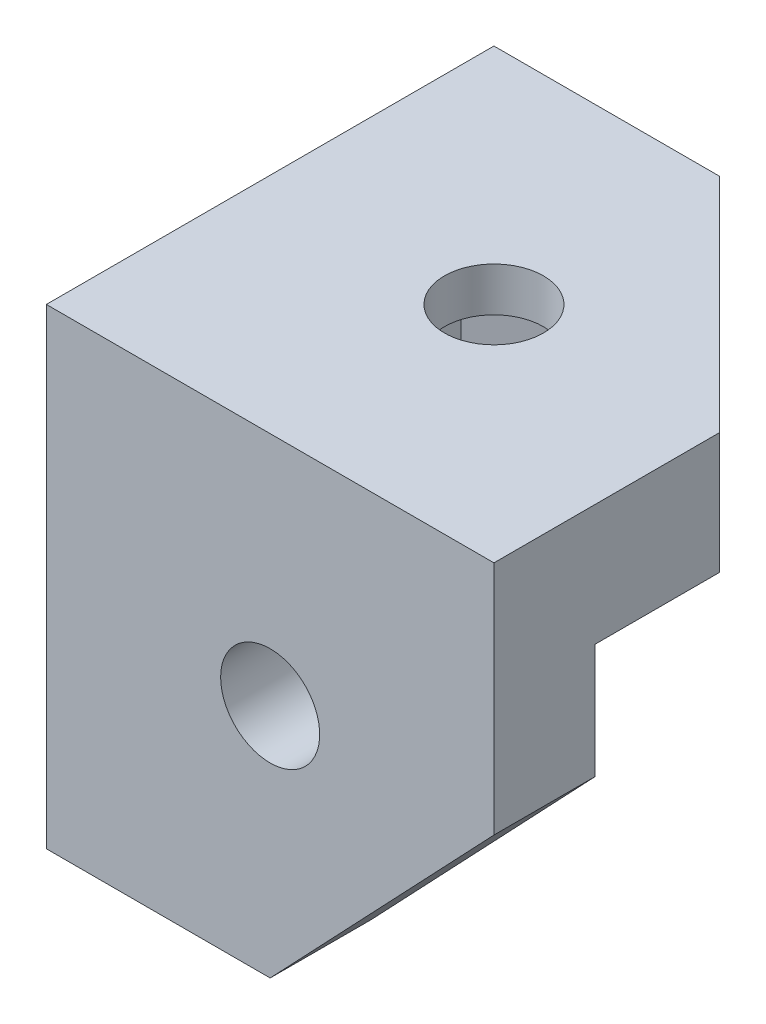
ISO-10303-21;
HEADER;
FILE_DESCRIPTION(('STEP AP214'),'2;1');
FILE_NAME('part.step','',(''),(''),'','','');
FILE_SCHEMA(('AUTOMOTIVE_DESIGN { 1 0 10303 214 1 1 1 1 }'));
ENDSEC;
DATA;
#1=APPLICATION_CONTEXT('core data for automotive mechanical design processes');
#2=APPLICATION_PROTOCOL_DEFINITION('international standard','automotive_design',2000,#1);
#3=PRODUCT_CONTEXT('',#1,'mechanical');
#4=PRODUCT('Part','Part','',(#3));
#5=PRODUCT_RELATED_PRODUCT_CATEGORY('part','',(#4));
#6=PRODUCT_DEFINITION_FORMATION('','',#4);
#7=PRODUCT_DEFINITION_CONTEXT('part definition',#1,'design');
#8=PRODUCT_DEFINITION('design','',#6,#7);
#9=PRODUCT_DEFINITION_SHAPE('','',#8);
#10=(LENGTH_UNIT() NAMED_UNIT(*) SI_UNIT(.MILLI.,.METRE.));
#11=(NAMED_UNIT(*) PLANE_ANGLE_UNIT() SI_UNIT($,.RADIAN.));
#12=(NAMED_UNIT(*) SI_UNIT($,.STERADIAN.) SOLID_ANGLE_UNIT());
#13=UNCERTAINTY_MEASURE_WITH_UNIT(LENGTH_MEASURE(1.E-05),#10,'distance_accuracy_value','');
#14=(GEOMETRIC_REPRESENTATION_CONTEXT(3) GLOBAL_UNCERTAINTY_ASSIGNED_CONTEXT((#13)) GLOBAL_UNIT_ASSIGNED_CONTEXT((#10,
#11,#12)) REPRESENTATION_CONTEXT('',''));
#15=CARTESIAN_POINT('',(0.,0.,0.));
#16=DIRECTION('',(0.,0.,1.));
#17=DIRECTION('',(1.,0.,0.));
#18=AXIS2_PLACEMENT_3D('',#15,#16,#17);
#19=CARTESIAN_POINT('',(16.14,34.000012,-16.14));
#20=DIRECTION('',(0.,-1.,0.));
#21=DIRECTION('',(0.,0.,-1.));
#22=AXIS2_PLACEMENT_3D('',#19,#20,#21);
#23=CYLINDRICAL_SURFACE('',#22,3.571875);
#24=CARTESIAN_POINT('',(16.14,34.,-16.14));
#25=DIRECTION('',(0.,-1.,0.));
#26=DIRECTION('',(0.,0.,-1.));
#27=AXIS2_PLACEMENT_3D('',#24,#25,#26);
#28=CIRCLE('',#27,3.571875);
#29=CARTESIAN_POINT('',(16.14,34.,-19.711875));
#30=VERTEX_POINT('',#29);
#31=EDGE_CURVE('E193',#30,#30,#28,.F.);
#32=ORIENTED_EDGE('',*,*,#31,.T.);
#33=EDGE_LOOP('',(#32));
#34=FACE_BOUND('',#33,.T.);
#35=CARTESIAN_POINT('',(16.14,30.825,-16.14));
#36=DIRECTION('',(0.,-1.,0.));
#37=DIRECTION('',(0.,0.,-1.));
#38=AXIS2_PLACEMENT_3D('',#35,#36,#37);
#39=CIRCLE('',#38,3.571875);
#40=CARTESIAN_POINT('',(16.14,30.825,-19.711875));
#41=VERTEX_POINT('',#40);
#42=EDGE_CURVE('E41',#41,#41,#39,.T.);
#43=ORIENTED_EDGE('',*,*,#42,.T.);
#44=EDGE_LOOP('',(#43));
#45=FACE_BOUND('',#44,.T.);
#46=ADVANCED_FACE('F37',(#34,#45),#23,.F.);
#47=CARTESIAN_POINT('',(0.,25.26875,0.));
#48=DIRECTION('',(0.,-1.,0.));
#49=DIRECTION('',(0.,0.,-1.));
#50=AXIS2_PLACEMENT_3D('',#47,#48,#49);
#51=PLANE('',#50);
#52=DIRECTION('',(0.707106781186548,0.,0.707106781186547));
#53=VECTOR('',#52,1.);
#54=CARTESIAN_POINT('',(16.2767142194378,25.26875,-32.28));
#55=LINE('',#54,#53);
#56=CARTESIAN_POINT('',(16.2767142194378,25.26875,-32.28));
#57=VERTEX_POINT('',#56);
#58=CARTESIAN_POINT('',(32.2799999999902,25.26875,-16.2767142194298));
#59=VERTEX_POINT('',#58);
#60=EDGE_CURVE('E306',#57,#59,#55,.T.);
#61=ORIENTED_EDGE('',*,*,#60,.T.);
#62=DIRECTION('',(0.,0.,1.));
#63=VECTOR('',#62,1.);
#64=CARTESIAN_POINT('',(32.2800000000711,25.26875,291559.995));
#65=LINE('',#64,#63);
#66=CARTESIAN_POINT('',(32.2800000000143,25.26875,-7.29257812498897));
#67=VERTEX_POINT('',#66);
#68=EDGE_CURVE('E200',#59,#67,#65,.T.);
#69=ORIENTED_EDGE('',*,*,#68,.T.);
#70=DIRECTION('',(-1.,0.,0.));
#71=VECTOR('',#70,1.);
#72=CARTESIAN_POINT('',(-399980.95,25.26875,-7.29257812497508));
#73=LINE('',#72,#71);
#74=CARTESIAN_POINT('',(7.29257812497508,25.26875,-7.29257812498896));
#75=VERTEX_POINT('',#74);
#76=EDGE_CURVE('E256',#67,#75,#73,.T.);
#77=ORIENTED_EDGE('',*,*,#76,.T.);
#78=DIRECTION('',(0.,0.,-1.));
#79=VECTOR('',#78,1.);
#80=CARTESIAN_POINT('',(7.29257812503192,25.26875,291559.995));
#81=LINE('',#80,#79);
#82=CARTESIAN_POINT('',(7.29257812500156,25.26875,-32.2800000000143));
#83=VERTEX_POINT('',#82);
#84=EDGE_CURVE('E252',#75,#83,#81,.T.);
#85=ORIENTED_EDGE('',*,*,#84,.T.);
#86=DIRECTION('',(1.,0.,0.));
#87=VECTOR('',#86,1.);
#88=CARTESIAN_POINT('',(-399980.95,25.26875,-32.2800000000143));
#89=LINE('',#88,#87);
#90=EDGE_CURVE('E255',#83,#57,#89,.T.);
#91=ORIENTED_EDGE('',*,*,#90,.T.);
#92=EDGE_LOOP('',(#61,#69,#77,#85,#91));
#93=FACE_BOUND('',#92,.T.);
#94=DIRECTION('',(0.866025403784439,0.,0.5));
#95=VECTOR('',#94,1.);
#96=CARTESIAN_POINT('',(8.19609063356097,25.26875,-14.196045400767));
#97=LINE('',#96,#95);
#98=CARTESIAN_POINT('',(10.4845312500572,25.26875,-12.8748135947916));
#99=VERTEX_POINT('',#98);
#100=CARTESIAN_POINT('',(16.140000000064,25.26875,-9.60962718960445));
#101=VERTEX_POINT('',#100);
#102=EDGE_CURVE('E46',#99,#101,#97,.T.);
#103=ORIENTED_EDGE('',*,*,#102,.T.);
#104=DIRECTION('',(0.866025403784439,0.,-0.5));
#105=VECTOR('',#104,1.);
#106=CARTESIAN_POINT('',(-0.126090633543185,25.26875,-0.218395383655346));
#107=LINE('',#106,#105);
#108=CARTESIAN_POINT('',(21.7954687499855,25.26875,-12.8748135947774));
#109=VERTEX_POINT('',#108);
#110=EDGE_CURVE('E12',#101,#109,#107,.T.);
#111=ORIENTED_EDGE('',*,*,#110,.T.);
#112=DIRECTION('',(0.,0.,-1.));
#113=VECTOR('',#112,1.);
#114=CARTESIAN_POINT('',(21.7954687499855,25.26875,0.));
#115=LINE('',#114,#113);
#116=CARTESIAN_POINT('',(21.7954687499855,25.26875,-19.4051864052796));
#117=VERTEX_POINT('',#116);
#118=EDGE_CURVE('E189',#109,#117,#115,.T.);
#119=ORIENTED_EDGE('',*,*,#118,.T.);
#120=DIRECTION('',(-0.866025403784439,0.,-0.5));
#121=VECTOR('',#120,1.);
#122=CARTESIAN_POINT('',(13.8515593835891,25.26875,-23.9916046164337));
#123=LINE('',#122,#121);
#124=CARTESIAN_POINT('',(16.1400000001777,25.26875,-22.6703728105235));
#125=VERTEX_POINT('',#124);
#126=EDGE_CURVE('E205',#117,#125,#123,.T.);
#127=ORIENTED_EDGE('',*,*,#126,.T.);
#128=DIRECTION('',(-0.866025403784439,0.,0.5));
#129=VECTOR('',#128,1.);
#130=CARTESIAN_POINT('',(-5.78155938354996,25.26875,-10.0139545992851));
#131=LINE('',#130,#129);
#132=CARTESIAN_POINT('',(10.4845312499926,25.26875,-19.4051864052653));
#133=VERTEX_POINT('',#132);
#134=EDGE_CURVE('E208',#125,#133,#131,.T.);
#135=ORIENTED_EDGE('',*,*,#134,.T.);
#136=DIRECTION('',(0.,0.,1.));
#137=VECTOR('',#136,1.);
#138=CARTESIAN_POINT('',(10.4845312499926,25.26875,0.));
#139=LINE('',#138,#137);
#140=EDGE_CURVE('E211',#133,#99,#139,.T.);
#141=ORIENTED_EDGE('',*,*,#140,.T.);
#142=EDGE_LOOP('',(#103,#111,#119,#127,#135,#141));
#143=FACE_BOUND('',#142,.T.);
#144=ADVANCED_FACE('F216',(#93,#143),#51,.T.);
#145=CARTESIAN_POINT('',(32.28,34.,-32.28));
#146=DIRECTION('',(-1.,0.,0.));
#147=DIRECTION('',(0.,0.,1.));
#148=AXIS2_PLACEMENT_3D('',#145,#146,#147);
#149=PLANE('',#148);
#150=DIRECTION('',(0.,-1.,0.));
#151=VECTOR('',#150,1.);
#152=CARTESIAN_POINT('',(32.28,34.,0.));
#153=LINE('',#152,#151);
#154=CARTESIAN_POINT('',(32.28,34.,0.));
#155=VERTEX_POINT('',#154);
#156=CARTESIAN_POINT('',(32.28,17.,0.));
#157=VERTEX_POINT('',#156);
#158=EDGE_CURVE('E185',#155,#157,#153,.T.);
#159=ORIENTED_EDGE('',*,*,#158,.T.);
#160=DIRECTION('',(0.,0.,1.));
#161=VECTOR('',#160,1.);
#162=CARTESIAN_POINT('',(32.28,17.,-30.7339859325418));
#163=LINE('',#162,#161);
#164=CARTESIAN_POINT('',(32.28,17.,-7.29257812498897));
#165=VERTEX_POINT('',#164);
#166=EDGE_CURVE('E152',#165,#157,#163,.T.);
#167=ORIENTED_EDGE('',*,*,#166,.F.);
#168=DIRECTION('',(0.,-1.,0.));
#169=VECTOR('',#168,1.);
#170=CARTESIAN_POINT('',(32.2800000000143,69.3375509044088,-7.29257812498897));
#171=LINE('',#170,#169);
#172=EDGE_CURVE('E249',#67,#165,#171,.T.);
#173=ORIENTED_EDGE('',*,*,#172,.F.);
#174=ORIENTED_EDGE('',*,*,#68,.F.);
#175=DIRECTION('',(0.,1.,0.));
#176=VECTOR('',#175,1.);
#177=CARTESIAN_POINT('',(32.28,-0.001000000000001,-16.2767142194378));
#178=LINE('',#177,#176);
#179=CARTESIAN_POINT('',(32.28,34.,-16.2767142194378));
#180=VERTEX_POINT('',#179);
#181=EDGE_CURVE('E311',#59,#180,#178,.T.);
#182=ORIENTED_EDGE('',*,*,#181,.T.);
#183=DIRECTION('',(0.,0.,-1.));
#184=VECTOR('',#183,1.);
#185=CARTESIAN_POINT('',(32.28,34.,-32.28));
#186=LINE('',#185,#184);
#187=EDGE_CURVE('E273',#155,#180,#186,.T.);
#188=ORIENTED_EDGE('',*,*,#187,.F.);
#189=EDGE_LOOP('',(#159,#167,#173,#174,#182,#188));
#190=FACE_BOUND('',#189,.T.);
#191=ADVANCED_FACE('F309',(#190),#149,.F.);
#192=CARTESIAN_POINT('',(0.,34.,-32.28));
#193=DIRECTION('',(0.,0.,1.));
#194=DIRECTION('',(1.,0.,0.));
#195=AXIS2_PLACEMENT_3D('',#192,#193,#194);
#196=PLANE('',#195);
#197=DIRECTION('',(0.,-1.,0.));
#198=VECTOR('',#197,1.);
#199=CARTESIAN_POINT('',(7.29257812500156,69.3375509044088,-32.2800000000143));
#200=LINE('',#199,#198);
#201=CARTESIAN_POINT('',(7.29257812500156,17.,-32.2800000000143));
#202=VERTEX_POINT('',#201);
#203=EDGE_CURVE('E265',#83,#202,#200,.T.);
#204=ORIENTED_EDGE('',*,*,#203,.T.);
#205=DIRECTION('',(-1.,0.,0.));
#206=VECTOR('',#205,1.);
#207=CARTESIAN_POINT('',(30.7339859325544,17.,-32.28));
#208=LINE('',#207,#206);
#209=CARTESIAN_POINT('',(0.,17.,-32.28));
#210=VERTEX_POINT('',#209);
#211=EDGE_CURVE('E61',#202,#210,#208,.T.);
#212=ORIENTED_EDGE('',*,*,#211,.T.);
#213=DIRECTION('',(0.,-1.,0.));
#214=VECTOR('',#213,1.);
#215=CARTESIAN_POINT('',(0.,34.,-32.28));
#216=LINE('',#215,#214);
#217=CARTESIAN_POINT('',(0.,34.,-32.28));
#218=VERTEX_POINT('',#217);
#219=EDGE_CURVE('E182',#218,#210,#216,.T.);
#220=ORIENTED_EDGE('',*,*,#219,.F.);
#221=DIRECTION('',(-1.,0.,0.));
#222=VECTOR('',#221,1.);
#223=CARTESIAN_POINT('',(0.,34.,-32.28));
#224=LINE('',#223,#222);
#225=CARTESIAN_POINT('',(16.2767142194378,34.,-32.28));
#226=VERTEX_POINT('',#225);
#227=EDGE_CURVE('E186',#226,#218,#224,.T.);
#228=ORIENTED_EDGE('',*,*,#227,.F.);
#229=DIRECTION('',(0.,1.,0.));
#230=VECTOR('',#229,1.);
#231=CARTESIAN_POINT('',(16.2767142194378,-0.001000000000001,-32.28));
#232=LINE('',#231,#230);
#233=EDGE_CURVE('E320',#57,#226,#232,.T.);
#234=ORIENTED_EDGE('',*,*,#233,.F.);
#235=ORIENTED_EDGE('',*,*,#90,.F.);
#236=EDGE_LOOP('',(#204,#212,#220,#228,#234,#235));
#237=FACE_BOUND('',#236,.T.);
#238=ADVANCED_FACE('F284',(#237),#196,.F.);
#239=CARTESIAN_POINT('',(0.,0.,0.));
#240=DIRECTION('',(0.,-1.,0.));
#241=DIRECTION('',(0.,0.,-1.));
#242=AXIS2_PLACEMENT_3D('',#239,#240,#241);
#243=PLANE('',#242);
#244=DIRECTION('',(0.,0.,1.));
#245=VECTOR('',#244,1.);
#246=CARTESIAN_POINT('',(16.14,0.,-30.7339859325418));
#247=LINE('',#246,#245);
#248=CARTESIAN_POINT('',(16.1400000000071,0.,-7.29257812498896));
#249=VERTEX_POINT('',#248);
#250=CARTESIAN_POINT('',(16.14,0.,0.));
#251=VERTEX_POINT('',#250);
#252=EDGE_CURVE('E53',#249,#251,#247,.T.);
#253=ORIENTED_EDGE('',*,*,#252,.T.);
#254=DIRECTION('',(1.,0.,0.));
#255=VECTOR('',#254,1.);
#256=CARTESIAN_POINT('',(0.,0.,0.));
#257=LINE('',#256,#255);
#258=CARTESIAN_POINT('',(0.,0.,0.));
#259=VERTEX_POINT('',#258);
#260=EDGE_CURVE('E164',#259,#251,#257,.T.);
#261=ORIENTED_EDGE('',*,*,#260,.F.);
#262=DIRECTION('',(0.,0.,1.));
#263=VECTOR('',#262,1.);
#264=CARTESIAN_POINT('',(0.,0.,0.));
#265=LINE('',#264,#263);
#266=CARTESIAN_POINT('',(0.,0.,-16.14));
#267=VERTEX_POINT('',#266);
#268=EDGE_CURVE('E173',#267,#259,#265,.T.);
#269=ORIENTED_EDGE('',*,*,#268,.F.);
#270=DIRECTION('',(-1.,0.,0.));
#271=VECTOR('',#270,1.);
#272=CARTESIAN_POINT('',(30.7339859325544,0.,-16.14));
#273=LINE('',#272,#271);
#274=CARTESIAN_POINT('',(7.29257812500156,0.,-16.14));
#275=VERTEX_POINT('',#274);
#276=EDGE_CURVE('E289',#275,#267,#273,.T.);
#277=ORIENTED_EDGE('',*,*,#276,.F.);
#278=DIRECTION('',(0.,0.,1.));
#279=VECTOR('',#278,1.);
#280=CARTESIAN_POINT('',(7.29257812503192,0.,291559.995));
#281=LINE('',#280,#279);
#282=CARTESIAN_POINT('',(7.29257812500156,0.,-7.29257812497508));
#283=VERTEX_POINT('',#282);
#284=EDGE_CURVE('E250',#275,#283,#281,.T.);
#285=ORIENTED_EDGE('',*,*,#284,.T.);
#286=DIRECTION('',(1.,0.,0.));
#287=VECTOR('',#286,1.);
#288=CARTESIAN_POINT('',(-399980.95,0.,-7.29257812497508));
#289=LINE('',#288,#287);
#290=EDGE_CURVE('E167',#283,#249,#289,.T.);
#291=ORIENTED_EDGE('',*,*,#290,.T.);
#292=EDGE_LOOP('',(#253,#261,#269,#277,#285,#291));
#293=FACE_BOUND('',#292,.T.);
#294=ADVANCED_FACE('F162',(#293),#243,.T.);
#295=CARTESIAN_POINT('',(16.14,17.,1.2E-05));
#296=DIRECTION('',(0.,0.,-1.));
#297=DIRECTION('',(-1.,0.,0.));
#298=AXIS2_PLACEMENT_3D('',#295,#296,#297);
#299=CYLINDRICAL_SURFACE('',#298,3.571875);
#300=CARTESIAN_POINT('',(16.14,17.,0.));
#301=DIRECTION('',(0.,0.,-1.));
#302=DIRECTION('',(-1.,0.,0.));
#303=AXIS2_PLACEMENT_3D('',#300,#301,#302);
#304=CIRCLE('',#303,3.571875);
#305=CARTESIAN_POINT('',(12.568125,17.,0.));
#306=VERTEX_POINT('',#305);
#307=EDGE_CURVE('E178',#306,#306,#304,.F.);
#308=ORIENTED_EDGE('',*,*,#307,.T.);
#309=EDGE_LOOP('',(#308));
#310=FACE_BOUND('',#309,.T.);
#311=CARTESIAN_POINT('',(16.14,17.,-7.29257812498896));
#312=DIRECTION('',(0.,0.,-1.));
#313=DIRECTION('',(-1.,0.,0.));
#314=AXIS2_PLACEMENT_3D('',#311,#312,#313);
#315=CIRCLE('',#314,3.571875);
#316=CARTESIAN_POINT('',(12.568125,17.,-7.29257812498896));
#317=VERTEX_POINT('',#316);
#318=EDGE_CURVE('E196',#317,#317,#315,.T.);
#319=ORIENTED_EDGE('',*,*,#318,.T.);
#320=EDGE_LOOP('',(#319));
#321=FACE_BOUND('',#320,.T.);
#322=ADVANCED_FACE('F376',(#310,#321),#299,.F.);
#323=CARTESIAN_POINT('',(8.334375,17.,-16.14));
#324=DIRECTION('',(-1.,0.,0.));
#325=DIRECTION('',(0.,0.,1.));
#326=AXIS2_PLACEMENT_3D('',#323,#324,#325);
#327=CYLINDRICAL_SURFACE('',#326,3.571875);
#328=CARTESIAN_POINT('',(0.,17.,-16.14));
#329=DIRECTION('',(-1.,0.,0.));
#330=DIRECTION('',(0.,0.,1.));
#331=AXIS2_PLACEMENT_3D('',#328,#329,#330);
#332=CIRCLE('',#331,3.571875);
#333=CARTESIAN_POINT('',(0.,17.,-12.568125));
#334=VERTEX_POINT('',#333);
#335=EDGE_CURVE('E192',#334,#334,#332,.T.);
#336=ORIENTED_EDGE('',*,*,#335,.T.);
#337=EDGE_LOOP('',(#336));
#338=FACE_BOUND('',#337,.T.);
#339=CARTESIAN_POINT('',(7.29257812500156,17.,-16.14));
#340=DIRECTION('',(1.,0.,0.));
#341=DIRECTION('',(0.,0.,-1.));
#342=AXIS2_PLACEMENT_3D('',#339,#340,#341);
#343=CIRCLE('',#342,3.571875);
#344=CARTESIAN_POINT('',(7.29257812500156,17.,-19.711875));
#345=VERTEX_POINT('',#344);
#346=EDGE_CURVE('E197',#345,#345,#343,.F.);
#347=ORIENTED_EDGE('',*,*,#346,.F.);
#348=EDGE_LOOP('',(#347));
#349=FACE_BOUND('',#348,.T.);
#350=ADVANCED_FACE('F373',(#338,#349),#327,.F.);
#351=CARTESIAN_POINT('',(0.,34.,0.));
#352=DIRECTION('',(1.,0.,0.));
#353=DIRECTION('',(0.,0.,-1.));
#354=AXIS2_PLACEMENT_3D('',#351,#352,#353);
#355=PLANE('',#354);
#356=ORIENTED_EDGE('',*,*,#335,.F.);
#357=EDGE_LOOP('',(#356));
#358=FACE_BOUND('',#357,.T.);
#359=ORIENTED_EDGE('',*,*,#219,.T.);
#360=DIRECTION('',(0.,0.725212416402848,-0.688525200043645));
#361=VECTOR('',#360,1.);
#362=CARTESIAN_POINT('',(0.,0.,-16.14));
#363=LINE('',#362,#361);
#364=EDGE_CURVE('E287',#267,#210,#363,.T.);
#365=ORIENTED_EDGE('',*,*,#364,.F.);
#366=ORIENTED_EDGE('',*,*,#268,.T.);
#367=DIRECTION('',(0.,-1.,0.));
#368=VECTOR('',#367,1.);
#369=CARTESIAN_POINT('',(0.,34.,0.));
#370=LINE('',#369,#368);
#371=CARTESIAN_POINT('',(0.,34.,0.));
#372=VERTEX_POINT('',#371);
#373=EDGE_CURVE('E171',#372,#259,#370,.T.);
#374=ORIENTED_EDGE('',*,*,#373,.F.);
#375=DIRECTION('',(0.,0.,1.));
#376=VECTOR('',#375,1.);
#377=CARTESIAN_POINT('',(0.,34.,0.));
#378=LINE('',#377,#376);
#379=EDGE_CURVE('E172',#218,#372,#378,.T.);
#380=ORIENTED_EDGE('',*,*,#379,.F.);
#381=EDGE_LOOP('',(#359,#365,#366,#374,#380));
#382=FACE_BOUND('',#381,.T.);
#383=ADVANCED_FACE('F39',(#358,#382),#355,.F.);
#384=CARTESIAN_POINT('',(0.,34.,0.));
#385=DIRECTION('',(0.,0.,-1.));
#386=DIRECTION('',(-1.,0.,0.));
#387=AXIS2_PLACEMENT_3D('',#384,#385,#386);
#388=PLANE('',#387);
#389=ORIENTED_EDGE('',*,*,#307,.F.);
#390=EDGE_LOOP('',(#389));
#391=FACE_BOUND('',#390,.T.);
#392=ORIENTED_EDGE('',*,*,#260,.T.);
#393=DIRECTION('',(-0.688525200043645,-0.725212416402848,0.));
#394=VECTOR('',#393,1.);
#395=CARTESIAN_POINT('',(16.14,0.,0.));
#396=LINE('',#395,#394);
#397=EDGE_CURVE('E149',#157,#251,#396,.T.);
#398=ORIENTED_EDGE('',*,*,#397,.F.);
#399=ORIENTED_EDGE('',*,*,#158,.F.);
#400=DIRECTION('',(1.,0.,0.));
#401=VECTOR('',#400,1.);
#402=CARTESIAN_POINT('',(0.,34.,0.));
#403=LINE('',#402,#401);
#404=EDGE_CURVE('E176',#372,#155,#403,.T.);
#405=ORIENTED_EDGE('',*,*,#404,.F.);
#406=ORIENTED_EDGE('',*,*,#373,.T.);
#407=EDGE_LOOP('',(#392,#398,#399,#405,#406));
#408=FACE_BOUND('',#407,.T.);
#409=ADVANCED_FACE('F169',(#391,#408),#388,.F.);
#410=CARTESIAN_POINT('',(0.,34.,0.));
#411=DIRECTION('',(0.,-1.,0.));
#412=DIRECTION('',(0.,0.,-1.));
#413=AXIS2_PLACEMENT_3D('',#410,#411,#412);
#414=PLANE('',#413);
#415=ORIENTED_EDGE('',*,*,#31,.F.);
#416=EDGE_LOOP('',(#415));
#417=FACE_BOUND('',#416,.T.);
#418=ORIENTED_EDGE('',*,*,#187,.T.);
#419=DIRECTION('',(0.707106781186548,0.,0.707106781186547));
#420=VECTOR('',#419,1.);
#421=CARTESIAN_POINT('',(16.2767142194378,34.,-32.28));
#422=LINE('',#421,#420);
#423=EDGE_CURVE('E281',#226,#180,#422,.T.);
#424=ORIENTED_EDGE('',*,*,#423,.F.);
#425=ORIENTED_EDGE('',*,*,#227,.T.);
#426=ORIENTED_EDGE('',*,*,#379,.T.);
#427=ORIENTED_EDGE('',*,*,#404,.T.);
#428=EDGE_LOOP('',(#418,#424,#425,#426,#427));
#429=FACE_BOUND('',#428,.T.);
#430=ADVANCED_FACE('F279',(#417,#429),#414,.F.);
#431=CARTESIAN_POINT('',(7.29257812503192,69.3375509044088,291559.995));
#432=DIRECTION('',(1.,0.,0.));
#433=DIRECTION('',(0.,0.,-1.));
#434=AXIS2_PLACEMENT_3D('',#431,#432,#433);
#435=PLANE('',#434);
#436=DIRECTION('',(0.,0.725212416402848,-0.688525200043645));
#437=VECTOR('',#436,1.);
#438=CARTESIAN_POINT('',(7.29257812500156,0.,-16.14));
#439=LINE('',#438,#437);
#440=EDGE_CURVE('E291',#275,#202,#439,.T.);
#441=ORIENTED_EDGE('',*,*,#440,.T.);
#442=ORIENTED_EDGE('',*,*,#203,.F.);
#443=ORIENTED_EDGE('',*,*,#84,.F.);
#444=DIRECTION('',(0.,-1.,0.));
#445=VECTOR('',#444,1.);
#446=CARTESIAN_POINT('',(7.29257812497508,69.3375509044088,-7.29257812498896));
#447=LINE('',#446,#445);
#448=EDGE_CURVE('E262',#75,#283,#447,.T.);
#449=ORIENTED_EDGE('',*,*,#448,.T.);
#450=ORIENTED_EDGE('',*,*,#284,.F.);
#451=EDGE_LOOP('',(#441,#442,#443,#449,#450));
#452=FACE_BOUND('',#451,.T.);
#453=ORIENTED_EDGE('',*,*,#346,.T.);
#454=EDGE_LOOP('',(#453));
#455=FACE_BOUND('',#454,.T.);
#456=ADVANCED_FACE('F294',(#452,#455),#435,.T.);
#457=CARTESIAN_POINT('',(-399980.95,69.3375509044088,-7.29257812497508));
#458=DIRECTION('',(0.,0.,-1.));
#459=DIRECTION('',(-1.,0.,0.));
#460=AXIS2_PLACEMENT_3D('',#457,#458,#459);
#461=PLANE('',#460);
#462=DIRECTION('',(-0.688525200043645,-0.725212416402848,0.));
#463=VECTOR('',#462,1.);
#464=CARTESIAN_POINT('',(16.14,0.,-7.29257812498896));
#465=LINE('',#464,#463);
#466=EDGE_CURVE('E157',#165,#249,#465,.T.);
#467=ORIENTED_EDGE('',*,*,#466,.T.);
#468=ORIENTED_EDGE('',*,*,#290,.F.);
#469=ORIENTED_EDGE('',*,*,#448,.F.);
#470=ORIENTED_EDGE('',*,*,#76,.F.);
#471=ORIENTED_EDGE('',*,*,#172,.T.);
#472=EDGE_LOOP('',(#467,#468,#469,#470,#471));
#473=FACE_BOUND('',#472,.T.);
#474=ORIENTED_EDGE('',*,*,#318,.F.);
#475=EDGE_LOOP('',(#474));
#476=FACE_BOUND('',#475,.T.);
#477=ADVANCED_FACE('F299',(#473,#476),#461,.T.);
#478=CARTESIAN_POINT('',(-426235.019789266,51.2777424250112,246086.612219533));
#479=DIRECTION('',(-0.5,0.,-0.866025403784439));
#480=DIRECTION('',(-0.866025403784439,0.,0.5));
#481=AXIS2_PLACEMENT_3D('',#478,#479,#480);
#482=PLANE('',#481);
#483=DIRECTION('',(0.,-1.,0.));
#484=VECTOR('',#483,1.);
#485=CARTESIAN_POINT('',(16.140000000064,51.2777424250112,-9.60962718960445));
#486=LINE('',#485,#484);
#487=CARTESIAN_POINT('',(16.140000000064,30.825,-9.60962718960445));
#488=VERTEX_POINT('',#487);
#489=EDGE_CURVE('E225',#488,#101,#486,.T.);
#490=ORIENTED_EDGE('',*,*,#489,.F.);
#491=DIRECTION('',(-0.866025403784439,0.,0.5));
#492=VECTOR('',#491,1.);
#493=CARTESIAN_POINT('',(-426235.019789266,30.825,246086.612219533));
#494=LINE('',#493,#492);
#495=CARTESIAN_POINT('',(21.7954687499855,30.825,-12.8748135948058));
#496=VERTEX_POINT('',#495);
#497=EDGE_CURVE('E244',#496,#488,#494,.T.);
#498=ORIENTED_EDGE('',*,*,#497,.F.);
#499=DIRECTION('',(0.,-1.,0.));
#500=VECTOR('',#499,1.);
#501=CARTESIAN_POINT('',(21.7954687499855,51.2777424250112,-12.8748135947774));
#502=LINE('',#501,#500);
#503=EDGE_CURVE('E236',#496,#109,#502,.T.);
#504=ORIENTED_EDGE('',*,*,#503,.T.);
#505=ORIENTED_EDGE('',*,*,#110,.F.);
#506=EDGE_LOOP('',(#490,#498,#504,#505));
#507=FACE_BOUND('',#506,.T.);
#508=ADVANCED_FACE('F336',(#507),#482,.T.);
#509=CARTESIAN_POINT('',(-173728.335210734,51.2777424250112,-100321.029160317));
#510=DIRECTION('',(0.5,0.,-0.866025403784439));
#511=DIRECTION('',(-0.866025403784439,0.,-0.5));
#512=AXIS2_PLACEMENT_3D('',#509,#510,#511);
#513=PLANE('',#512);
#514=DIRECTION('',(0.,-1.,0.));
#515=VECTOR('',#514,1.);
#516=CARTESIAN_POINT('',(10.4845312500572,51.2777424250112,-12.8748135947916));
#517=LINE('',#516,#515);
#518=CARTESIAN_POINT('',(10.4845312500572,30.825,-12.8748135948058));
#519=VERTEX_POINT('',#518);
#520=EDGE_CURVE('E222',#519,#99,#517,.T.);
#521=ORIENTED_EDGE('',*,*,#520,.F.);
#522=DIRECTION('',(-0.866025403784439,0.,-0.5));
#523=VECTOR('',#522,1.);
#524=CARTESIAN_POINT('',(-173728.335210734,30.825,-100321.029160317));
#525=LINE('',#524,#523);
#526=EDGE_CURVE('E247',#488,#519,#525,.T.);
#527=ORIENTED_EDGE('',*,*,#526,.F.);
#528=ORIENTED_EDGE('',*,*,#489,.T.);
#529=ORIENTED_EDGE('',*,*,#102,.F.);
#530=EDGE_LOOP('',(#521,#527,#528,#529));
#531=FACE_BOUND('',#530,.T.);
#532=ADVANCED_FACE('F221',(#531),#513,.T.);
#533=CARTESIAN_POINT('',(10.4845312499151,51.2777424250112,291559.995));
#534=DIRECTION('',(1.,0.,0.));
#535=DIRECTION('',(0.,0.,-1.));
#536=AXIS2_PLACEMENT_3D('',#533,#534,#535);
#537=PLANE('',#536);
#538=DIRECTION('',(0.,-1.,0.));
#539=VECTOR('',#538,1.);
#540=CARTESIAN_POINT('',(10.4845312499926,51.2777424250112,-19.4051864052653));
#541=LINE('',#540,#539);
#542=CARTESIAN_POINT('',(10.4845312499926,30.825,-19.4051864052653));
#543=VERTEX_POINT('',#542);
#544=EDGE_CURVE('E232',#543,#133,#541,.T.);
#545=ORIENTED_EDGE('',*,*,#544,.F.);
#546=DIRECTION('',(0.,0.,-1.));
#547=VECTOR('',#546,1.);
#548=CARTESIAN_POINT('',(10.4845312499151,30.825,291559.995));
#549=LINE('',#548,#547);
#550=EDGE_CURVE('E231',#519,#543,#549,.T.);
#551=ORIENTED_EDGE('',*,*,#550,.F.);
#552=ORIENTED_EDGE('',*,*,#520,.T.);
#553=ORIENTED_EDGE('',*,*,#140,.F.);
#554=EDGE_LOOP('',(#545,#551,#552,#553));
#555=FACE_BOUND('',#554,.T.);
#556=ADVANCED_FACE('F228',(#555),#537,.T.);
#557=CARTESIAN_POINT('',(-426240.675258016,51.2777424250112,246076.816660317));
#558=DIRECTION('',(0.5,0.,0.866025403784439));
#559=DIRECTION('',(0.866025403784439,0.,-0.5));
#560=AXIS2_PLACEMENT_3D('',#557,#558,#559);
#561=PLANE('',#560);
#562=DIRECTION('',(0.,-1.,0.));
#563=VECTOR('',#562,1.);
#564=CARTESIAN_POINT('',(16.1400000001777,51.2777424250112,-22.6703728105235));
#565=LINE('',#564,#563);
#566=CARTESIAN_POINT('',(16.1400000001777,30.825,-22.6703728105235));
#567=VERTEX_POINT('',#566);
#568=EDGE_CURVE('E234',#567,#125,#565,.T.);
#569=ORIENTED_EDGE('',*,*,#568,.F.);
#570=DIRECTION('',(0.866025403784439,0.,-0.5));
#571=VECTOR('',#570,1.);
#572=CARTESIAN_POINT('',(-426240.675258016,30.825,246076.816660317));
#573=LINE('',#572,#571);
#574=EDGE_CURVE('E325',#543,#567,#573,.T.);
#575=ORIENTED_EDGE('',*,*,#574,.F.);
#576=ORIENTED_EDGE('',*,*,#544,.T.);
#577=ORIENTED_EDGE('',*,*,#134,.F.);
#578=EDGE_LOOP('',(#569,#575,#576,#577));
#579=FACE_BOUND('',#578,.T.);
#580=ADVANCED_FACE('F345',(#579),#561,.T.);
#581=CARTESIAN_POINT('',(-173722.679741984,51.2777424250112,-100330.824719533));
#582=DIRECTION('',(-0.5,0.,0.866025403784439));
#583=DIRECTION('',(0.866025403784439,0.,0.5));
#584=AXIS2_PLACEMENT_3D('',#581,#582,#583);
#585=PLANE('',#584);
#586=DIRECTION('',(0.,-1.,0.));
#587=VECTOR('',#586,1.);
#588=CARTESIAN_POINT('',(21.7954687500708,51.2777424250112,-19.4051864052796));
#589=LINE('',#588,#587);
#590=CARTESIAN_POINT('',(21.7954687500708,30.825,-19.4051864052796));
#591=VERTEX_POINT('',#590);
#592=EDGE_CURVE('E242',#591,#117,#589,.T.);
#593=ORIENTED_EDGE('',*,*,#592,.F.);
#594=DIRECTION('',(0.866025403784439,0.,0.5));
#595=VECTOR('',#594,1.);
#596=CARTESIAN_POINT('',(-173722.679741984,30.825,-100330.824719533));
#597=LINE('',#596,#595);
#598=EDGE_CURVE('E328',#567,#591,#597,.T.);
#599=ORIENTED_EDGE('',*,*,#598,.F.);
#600=ORIENTED_EDGE('',*,*,#568,.T.);
#601=ORIENTED_EDGE('',*,*,#126,.F.);
#602=EDGE_LOOP('',(#593,#599,#600,#601));
#603=FACE_BOUND('',#602,.T.);
#604=ADVANCED_FACE('F342',(#603),#585,.T.);
#605=CARTESIAN_POINT('',(21.7954687499855,51.2777424250112,291559.995));
#606=DIRECTION('',(-1.,0.,0.));
#607=DIRECTION('',(0.,0.,1.));
#608=AXIS2_PLACEMENT_3D('',#605,#606,#607);
#609=PLANE('',#608);
#610=ORIENTED_EDGE('',*,*,#503,.F.);
#611=DIRECTION('',(0.,0.,1.));
#612=VECTOR('',#611,1.);
#613=CARTESIAN_POINT('',(21.7954687499855,30.825,291559.995));
#614=LINE('',#613,#612);
#615=EDGE_CURVE('E331',#591,#496,#614,.T.);
#616=ORIENTED_EDGE('',*,*,#615,.F.);
#617=ORIENTED_EDGE('',*,*,#592,.T.);
#618=ORIENTED_EDGE('',*,*,#118,.F.);
#619=EDGE_LOOP('',(#610,#616,#617,#618));
#620=FACE_BOUND('',#619,.T.);
#621=ADVANCED_FACE('F338',(#620),#609,.T.);
#622=CARTESIAN_POINT('',(0.,30.825,0.));
#623=DIRECTION('',(0.,-1.,0.));
#624=DIRECTION('',(0.,0.,-1.));
#625=AXIS2_PLACEMENT_3D('',#622,#623,#624);
#626=PLANE('',#625);
#627=ORIENTED_EDGE('',*,*,#42,.F.);
#628=EDGE_LOOP('',(#627));
#629=FACE_BOUND('',#628,.T.);
#630=ORIENTED_EDGE('',*,*,#598,.T.);
#631=ORIENTED_EDGE('',*,*,#615,.T.);
#632=ORIENTED_EDGE('',*,*,#497,.T.);
#633=ORIENTED_EDGE('',*,*,#526,.T.);
#634=ORIENTED_EDGE('',*,*,#550,.T.);
#635=ORIENTED_EDGE('',*,*,#574,.T.);
#636=EDGE_LOOP('',(#630,#631,#632,#633,#634,#635));
#637=FACE_BOUND('',#636,.T.);
#638=ADVANCED_FACE('F347',(#629,#637),#626,.T.);
#639=CARTESIAN_POINT('',(16.2767142194378,-0.001000000000001,-32.28));
#640=DIRECTION('',(-0.707106781186547,0.,0.707106781186548));
#641=DIRECTION('',(0.707106781186548,0.,0.707106781186547));
#642=AXIS2_PLACEMENT_3D('',#639,#640,#641);
#643=PLANE('',#642);
#644=ORIENTED_EDGE('',*,*,#233,.T.);
#645=ORIENTED_EDGE('',*,*,#423,.T.);
#646=ORIENTED_EDGE('',*,*,#181,.F.);
#647=ORIENTED_EDGE('',*,*,#60,.F.);
#648=EDGE_LOOP('',(#644,#645,#646,#647));
#649=FACE_BOUND('',#648,.T.);
#650=ADVANCED_FACE('F349',(#649),#643,.F.);
#651=CARTESIAN_POINT('',(30.7339859325544,0.,-16.14));
#652=DIRECTION('',(0.,0.688525200043645,0.725212416402848));
#653=DIRECTION('',(0.,-0.725212416402848,0.688525200043645));
#654=AXIS2_PLACEMENT_3D('',#651,#652,#653);
#655=PLANE('',#654);
#656=ORIENTED_EDGE('',*,*,#276,.T.);
#657=ORIENTED_EDGE('',*,*,#364,.T.);
#658=ORIENTED_EDGE('',*,*,#211,.F.);
#659=ORIENTED_EDGE('',*,*,#440,.F.);
#660=EDGE_LOOP('',(#656,#657,#658,#659));
#661=FACE_BOUND('',#660,.T.);
#662=ADVANCED_FACE('F356',(#661),#655,.F.);
#663=CARTESIAN_POINT('',(16.14,0.,-30.7339859325418));
#664=DIRECTION('',(-0.725212416402848,0.688525200043645,0.));
#665=DIRECTION('',(-0.688525200043645,-0.725212416402848,0.));
#666=AXIS2_PLACEMENT_3D('',#663,#664,#665);
#667=PLANE('',#666);
#668=ORIENTED_EDGE('',*,*,#166,.T.);
#669=ORIENTED_EDGE('',*,*,#397,.T.);
#670=ORIENTED_EDGE('',*,*,#252,.F.);
#671=ORIENTED_EDGE('',*,*,#466,.F.);
#672=EDGE_LOOP('',(#668,#669,#670,#671));
#673=FACE_BOUND('',#672,.T.);
#674=ADVANCED_FACE('F150',(#673),#667,.F.);
#675=CLOSED_SHELL('',(#46,#144,#191,#238,#294,#322,#350,#383,#409,#430,#456,#477,#508,#532,#556,
#580,#604,#621,#638,#650,#662,#674));
#676=MANIFOLD_SOLID_BREP('B2',#675);
#677=ADVANCED_BREP_SHAPE_REPRESENTATION('',(#18,#676),#14);
#678=SHAPE_DEFINITION_REPRESENTATION(#9,#677);
ENDSEC;
END-ISO-10303-21;
